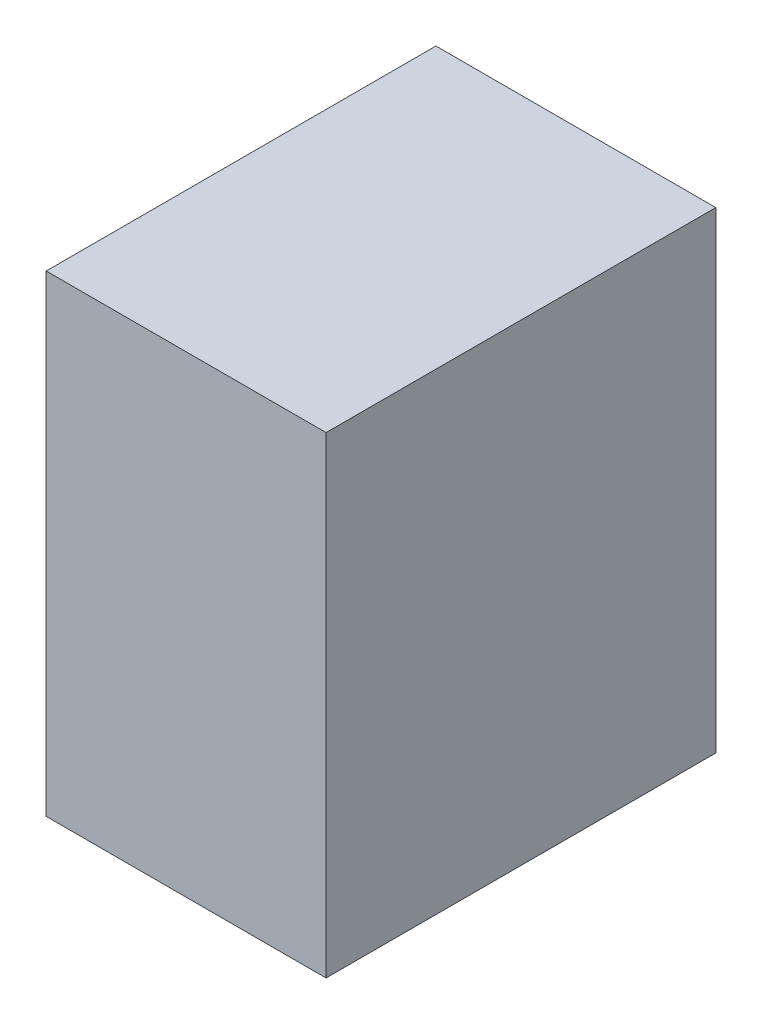
ISO-10303-21;
HEADER;
FILE_DESCRIPTION(('STEP AP214'),'2;1');
FILE_NAME('part.step','',(''),(''),'','','');
FILE_SCHEMA(('AUTOMOTIVE_DESIGN { 1 0 10303 214 1 1 1 1 }'));
ENDSEC;
DATA;
#1=APPLICATION_CONTEXT('core data for automotive mechanical design processes');
#2=APPLICATION_PROTOCOL_DEFINITION('international standard','automotive_design',2000,#1);
#3=PRODUCT_CONTEXT('',#1,'mechanical');
#4=PRODUCT('Part','Part','',(#3));
#5=PRODUCT_RELATED_PRODUCT_CATEGORY('part','',(#4));
#6=PRODUCT_DEFINITION_FORMATION('','',#4);
#7=PRODUCT_DEFINITION_CONTEXT('part definition',#1,'design');
#8=PRODUCT_DEFINITION('design','',#6,#7);
#9=PRODUCT_DEFINITION_SHAPE('','',#8);
#10=(LENGTH_UNIT() NAMED_UNIT(*) SI_UNIT(.MILLI.,.METRE.));
#11=(NAMED_UNIT(*) PLANE_ANGLE_UNIT() SI_UNIT($,.RADIAN.));
#12=(NAMED_UNIT(*) SI_UNIT($,.STERADIAN.) SOLID_ANGLE_UNIT());
#13=UNCERTAINTY_MEASURE_WITH_UNIT(LENGTH_MEASURE(1.E-05),#10,'distance_accuracy_value','');
#14=(GEOMETRIC_REPRESENTATION_CONTEXT(3) GLOBAL_UNCERTAINTY_ASSIGNED_CONTEXT((#13)) GLOBAL_UNIT_ASSIGNED_CONTEXT((#10,
#11,#12)) REPRESENTATION_CONTEXT('',''));
#15=CARTESIAN_POINT('',(0.,0.,0.));
#16=DIRECTION('',(0.,0.,1.));
#17=DIRECTION('',(1.,0.,0.));
#18=AXIS2_PLACEMENT_3D('',#15,#16,#17);
#19=CARTESIAN_POINT('',(0.8715,0.2,0.));
#20=DIRECTION('',(1.,0.,0.));
#21=DIRECTION('',(0.,0.,-1.));
#22=AXIS2_PLACEMENT_3D('',#19,#20,#21);
#23=PLANE('',#22);
#24=DIRECTION('',(0.,0.,-1.));
#25=VECTOR('',#24,1.);
#26=CARTESIAN_POINT('',(0.8715,-0.2,0.));
#27=LINE('',#26,#25);
#28=CARTESIAN_POINT('',(0.8715,-0.2,0.));
#29=VERTEX_POINT('',#28);
#30=CARTESIAN_POINT('',(0.8715,-0.2,0.33));
#31=VERTEX_POINT('',#30);
#32=EDGE_CURVE('E19',#29,#31,#27,.F.);
#33=ORIENTED_EDGE('',*,*,#32,.F.);
#34=DIRECTION('',(0.,1.,0.));
#35=VECTOR('',#34,1.);
#36=CARTESIAN_POINT('',(0.8715,-0.2,0.));
#37=LINE('',#36,#35);
#38=CARTESIAN_POINT('',(0.8715,0.2,0.));
#39=VERTEX_POINT('',#38);
#40=EDGE_CURVE('E79',#29,#39,#37,.T.);
#41=ORIENTED_EDGE('',*,*,#40,.T.);
#42=DIRECTION('',(0.,0.,1.));
#43=VECTOR('',#42,1.);
#44=CARTESIAN_POINT('',(0.8715,0.2,0.));
#45=LINE('',#44,#43);
#46=CARTESIAN_POINT('',(0.8715,0.2,0.33));
#47=VERTEX_POINT('',#46);
#48=EDGE_CURVE('E67',#47,#39,#45,.F.);
#49=ORIENTED_EDGE('',*,*,#48,.F.);
#50=DIRECTION('',(0.,1.,0.));
#51=VECTOR('',#50,1.);
#52=CARTESIAN_POINT('',(0.8715,-0.2,0.33));
#53=LINE('',#52,#51);
#54=EDGE_CURVE('E55',#31,#47,#53,.T.);
#55=ORIENTED_EDGE('',*,*,#54,.F.);
#56=EDGE_LOOP('',(#33,#41,#49,#55));
#57=FACE_BOUND('',#56,.T.);
#58=ADVANCED_FACE('F16',(#57),#23,.T.);
#59=CARTESIAN_POINT('',(0.8715,-0.2,0.));
#60=DIRECTION('',(0.,-1.,0.));
#61=DIRECTION('',(0.,0.,-1.));
#62=AXIS2_PLACEMENT_3D('',#59,#60,#61);
#63=PLANE('',#62);
#64=DIRECTION('',(0.,0.,1.));
#65=VECTOR('',#64,1.);
#66=CARTESIAN_POINT('',(0.6345,-0.2,0.));
#67=LINE('',#66,#65);
#68=CARTESIAN_POINT('',(0.6345,-0.2,0.));
#69=VERTEX_POINT('',#68);
#70=CARTESIAN_POINT('',(0.6345,-0.2,0.33));
#71=VERTEX_POINT('',#70);
#72=EDGE_CURVE('E82',#69,#71,#67,.T.);
#73=ORIENTED_EDGE('',*,*,#72,.F.);
#74=DIRECTION('',(1.,0.,0.));
#75=VECTOR('',#74,1.);
#76=CARTESIAN_POINT('',(0.6345,-0.2,0.));
#77=LINE('',#76,#75);
#78=EDGE_CURVE('E64',#69,#29,#77,.T.);
#79=ORIENTED_EDGE('',*,*,#78,.T.);
#80=ORIENTED_EDGE('',*,*,#32,.T.);
#81=DIRECTION('',(1.,0.,0.));
#82=VECTOR('',#81,1.);
#83=CARTESIAN_POINT('',(0.6345,-0.2,0.33));
#84=LINE('',#83,#82);
#85=EDGE_CURVE('E61',#71,#31,#84,.T.);
#86=ORIENTED_EDGE('',*,*,#85,.F.);
#87=EDGE_LOOP('',(#73,#79,#80,#86));
#88=FACE_BOUND('',#87,.T.);
#89=ADVANCED_FACE('F60',(#88),#63,.T.);
#90=CARTESIAN_POINT('',(0.6345,-0.2,0.33));
#91=DIRECTION('',(0.,0.,1.));
#92=DIRECTION('',(1.,0.,0.));
#93=AXIS2_PLACEMENT_3D('',#90,#91,#92);
#94=PLANE('',#93);
#95=DIRECTION('',(1.,0.,0.));
#96=VECTOR('',#95,1.);
#97=CARTESIAN_POINT('',(0.6345,0.2,0.33));
#98=LINE('',#97,#96);
#99=CARTESIAN_POINT('',(0.6345,0.2,0.33));
#100=VERTEX_POINT('',#99);
#101=EDGE_CURVE('E69',#100,#47,#98,.T.);
#102=ORIENTED_EDGE('',*,*,#101,.F.);
#103=DIRECTION('',(0.,1.,0.));
#104=VECTOR('',#103,1.);
#105=CARTESIAN_POINT('',(0.6345,-0.2,0.33));
#106=LINE('',#105,#104);
#107=EDGE_CURVE('E73',#71,#100,#106,.T.);
#108=ORIENTED_EDGE('',*,*,#107,.F.);
#109=ORIENTED_EDGE('',*,*,#85,.T.);
#110=ORIENTED_EDGE('',*,*,#54,.T.);
#111=EDGE_LOOP('',(#102,#108,#109,#110));
#112=FACE_BOUND('',#111,.T.);
#113=ADVANCED_FACE('F71',(#112),#94,.T.);
#114=CARTESIAN_POINT('',(0.6345,0.2,0.));
#115=DIRECTION('',(0.,1.,0.));
#116=DIRECTION('',(0.,0.,1.));
#117=AXIS2_PLACEMENT_3D('',#114,#115,#116);
#118=PLANE('',#117);
#119=ORIENTED_EDGE('',*,*,#48,.T.);
#120=DIRECTION('',(1.,0.,0.));
#121=VECTOR('',#120,1.);
#122=CARTESIAN_POINT('',(0.6345,0.2,0.));
#123=LINE('',#122,#121);
#124=CARTESIAN_POINT('',(0.6345,0.2,0.));
#125=VERTEX_POINT('',#124);
#126=EDGE_CURVE('E34',#39,#125,#123,.F.);
#127=ORIENTED_EDGE('',*,*,#126,.T.);
#128=DIRECTION('',(0.,0.,1.));
#129=VECTOR('',#128,1.);
#130=CARTESIAN_POINT('',(0.6345,0.2,0.));
#131=LINE('',#130,#129);
#132=EDGE_CURVE('E25',#100,#125,#131,.F.);
#133=ORIENTED_EDGE('',*,*,#132,.F.);
#134=ORIENTED_EDGE('',*,*,#101,.T.);
#135=EDGE_LOOP('',(#119,#127,#133,#134));
#136=FACE_BOUND('',#135,.T.);
#137=ADVANCED_FACE('F88',(#136),#118,.T.);
#138=CARTESIAN_POINT('',(0.6345,-0.2,0.));
#139=DIRECTION('',(0.,0.,1.));
#140=DIRECTION('',(1.,0.,0.));
#141=AXIS2_PLACEMENT_3D('',#138,#139,#140);
#142=PLANE('',#141);
#143=ORIENTED_EDGE('',*,*,#126,.F.);
#144=ORIENTED_EDGE('',*,*,#40,.F.);
#145=ORIENTED_EDGE('',*,*,#78,.F.);
#146=DIRECTION('',(0.,1.,0.));
#147=VECTOR('',#146,1.);
#148=CARTESIAN_POINT('',(0.6345,-0.2,0.));
#149=LINE('',#148,#147);
#150=EDGE_CURVE('E11',#125,#69,#149,.F.);
#151=ORIENTED_EDGE('',*,*,#150,.F.);
#152=EDGE_LOOP('',(#143,#144,#145,#151));
#153=FACE_BOUND('',#152,.T.);
#154=ADVANCED_FACE('F90',(#153),#142,.F.);
#155=CARTESIAN_POINT('',(0.6345,-0.2,0.));
#156=DIRECTION('',(-1.,0.,0.));
#157=DIRECTION('',(0.,0.,1.));
#158=AXIS2_PLACEMENT_3D('',#155,#156,#157);
#159=PLANE('',#158);
#160=ORIENTED_EDGE('',*,*,#132,.T.);
#161=ORIENTED_EDGE('',*,*,#150,.T.);
#162=ORIENTED_EDGE('',*,*,#72,.T.);
#163=ORIENTED_EDGE('',*,*,#107,.T.);
#164=EDGE_LOOP('',(#160,#161,#162,#163));
#165=FACE_BOUND('',#164,.T.);
#166=ADVANCED_FACE('F87',(#165),#159,.T.);
#167=CLOSED_SHELL('',(#58,#89,#113,#137,#154,#166));
#168=MANIFOLD_SOLID_BREP('B1',#167);
#169=ADVANCED_BREP_SHAPE_REPRESENTATION('',(#18,#168),#14);
#170=SHAPE_DEFINITION_REPRESENTATION(#9,#169);
ENDSEC;
END-ISO-10303-21;
